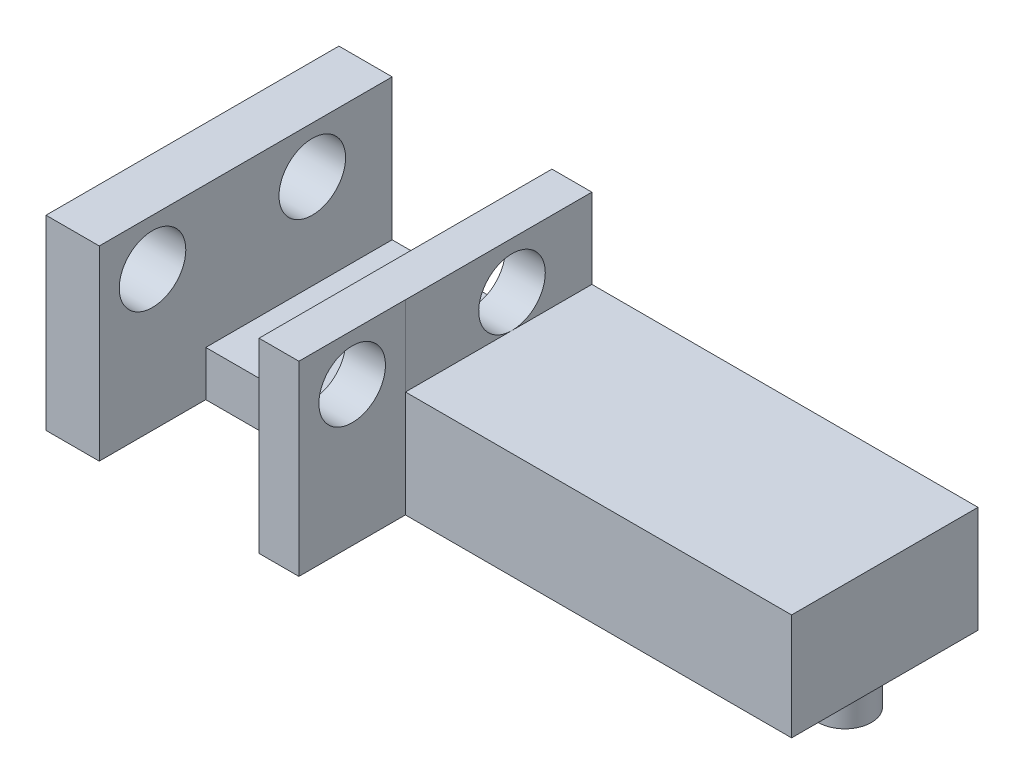
ISO-10303-21;
HEADER;
FILE_DESCRIPTION(('STEP AP214'),'2;1');
FILE_NAME('part.step','',(''),(''),'','','');
FILE_SCHEMA(('AUTOMOTIVE_DESIGN { 1 0 10303 214 1 1 1 1 }'));
ENDSEC;
DATA;
#1=APPLICATION_CONTEXT('core data for automotive mechanical design processes');
#2=APPLICATION_PROTOCOL_DEFINITION('international standard','automotive_design',2000,#1);
#3=PRODUCT_CONTEXT('',#1,'mechanical');
#4=PRODUCT('Part','Part','',(#3));
#5=PRODUCT_RELATED_PRODUCT_CATEGORY('part','',(#4));
#6=PRODUCT_DEFINITION_FORMATION('','',#4);
#7=PRODUCT_DEFINITION_CONTEXT('part definition',#1,'design');
#8=PRODUCT_DEFINITION('design','',#6,#7);
#9=PRODUCT_DEFINITION_SHAPE('','',#8);
#10=(LENGTH_UNIT() NAMED_UNIT(*) SI_UNIT(.MILLI.,.METRE.));
#11=(NAMED_UNIT(*) PLANE_ANGLE_UNIT() SI_UNIT($,.RADIAN.));
#12=(NAMED_UNIT(*) SI_UNIT($,.STERADIAN.) SOLID_ANGLE_UNIT());
#13=UNCERTAINTY_MEASURE_WITH_UNIT(LENGTH_MEASURE(1.E-05),#10,'distance_accuracy_value','');
#14=(GEOMETRIC_REPRESENTATION_CONTEXT(3) GLOBAL_UNCERTAINTY_ASSIGNED_CONTEXT((#13)) GLOBAL_UNIT_ASSIGNED_CONTEXT((#10,
#11,#12)) REPRESENTATION_CONTEXT('',''));
#15=CARTESIAN_POINT('',(0.,0.,0.));
#16=DIRECTION('',(0.,0.,1.));
#17=DIRECTION('',(1.,0.,0.));
#18=AXIS2_PLACEMENT_3D('',#15,#16,#17);
#19=CARTESIAN_POINT('',(0.,0.,3.));
#20=DIRECTION('',(0.,0.,-1.));
#21=DIRECTION('',(-1.,0.,0.));
#22=AXIS2_PLACEMENT_3D('',#19,#20,#21);
#23=PLANE('',#22);
#24=DIRECTION('',(0.,-1.,0.));
#25=VECTOR('',#24,1.);
#26=CARTESIAN_POINT('',(-17.,7.,3.));
#27=LINE('',#26,#25);
#28=CARTESIAN_POINT('',(-17.,1.7,3.));
#29=VERTEX_POINT('',#28);
#30=CARTESIAN_POINT('',(-17.,0.,3.));
#31=VERTEX_POINT('',#30);
#32=EDGE_CURVE('E168',#29,#31,#27,.T.);
#33=ORIENTED_EDGE('',*,*,#32,.F.);
#34=DIRECTION('',(1.,0.,0.));
#35=VECTOR('',#34,1.);
#36=CARTESIAN_POINT('',(0.,1.7,3.));
#37=LINE('',#36,#35);
#38=CARTESIAN_POINT('',(-23.,1.7,3.));
#39=VERTEX_POINT('',#38);
#40=EDGE_CURVE('E216',#39,#29,#37,.T.);
#41=ORIENTED_EDGE('',*,*,#40,.F.);
#42=DIRECTION('',(0.,1.,0.));
#43=VECTOR('',#42,1.);
#44=CARTESIAN_POINT('',(-23.,7.,3.));
#45=LINE('',#44,#43);
#46=CARTESIAN_POINT('',(-23.,0.,3.));
#47=VERTEX_POINT('',#46);
#48=EDGE_CURVE('E169',#47,#39,#45,.T.);
#49=ORIENTED_EDGE('',*,*,#48,.F.);
#50=DIRECTION('',(1.,0.,0.));
#51=VECTOR('',#50,1.);
#52=CARTESIAN_POINT('',(-25.,0.,3.));
#53=LINE('',#52,#51);
#54=EDGE_CURVE('E232',#47,#31,#53,.T.);
#55=ORIENTED_EDGE('',*,*,#54,.T.);
#56=EDGE_LOOP('',(#33,#41,#49,#55));
#57=FACE_BOUND('',#56,.T.);
#58=ADVANCED_FACE('F37',(#57),#23,.F.);
#59=DIRECTION('',(0.,1.,0.));
#60=VECTOR('',#59,1.);
#61=CARTESIAN_POINT('',(-15.5025294120522,7.,3.));
#62=LINE('',#61,#60);
#63=CARTESIAN_POINT('',(-15.5025294120522,0.,3.));
#64=VERTEX_POINT('',#63);
#65=CARTESIAN_POINT('',(-15.5025294120522,7.,3.));
#66=VERTEX_POINT('',#65);
#67=EDGE_CURVE('E164',#64,#66,#62,.T.);
#68=ORIENTED_EDGE('',*,*,#67,.F.);
#69=CARTESIAN_POINT('',(-1.,0.,3.));
#70=VERTEX_POINT('',#69);
#71=EDGE_CURVE('E230',#64,#70,#53,.T.);
#72=ORIENTED_EDGE('',*,*,#71,.T.);
#73=DIRECTION('',(0.,1.,0.));
#74=VECTOR('',#73,1.);
#75=CARTESIAN_POINT('',(-1.,0.,3.));
#76=LINE('',#75,#74);
#77=CARTESIAN_POINT('',(-1.,4.,3.));
#78=VERTEX_POINT('',#77);
#79=EDGE_CURVE('E234',#70,#78,#76,.T.);
#80=ORIENTED_EDGE('',*,*,#79,.T.);
#81=DIRECTION('',(-1.,0.,0.));
#82=VECTOR('',#81,1.);
#83=CARTESIAN_POINT('',(-25.,4.,3.));
#84=LINE('',#83,#82);
#85=CARTESIAN_POINT('',(-15.5,4.,3.));
#86=VERTEX_POINT('',#85);
#87=EDGE_CURVE('E237',#78,#86,#84,.T.);
#88=ORIENTED_EDGE('',*,*,#87,.T.);
#89=DIRECTION('',(0.,-1.,0.));
#90=VECTOR('',#89,1.);
#91=CARTESIAN_POINT('',(-15.5,7.,3.));
#92=LINE('',#91,#90);
#93=CARTESIAN_POINT('',(-15.5,7.,3.));
#94=VERTEX_POINT('',#93);
#95=EDGE_CURVE('E206',#94,#86,#92,.T.);
#96=ORIENTED_EDGE('',*,*,#95,.F.);
#97=DIRECTION('',(1.,0.,0.));
#98=VECTOR('',#97,1.);
#99=CARTESIAN_POINT('',(-17.,7.,3.));
#100=LINE('',#99,#98);
#101=EDGE_CURVE('E193',#66,#94,#100,.T.);
#102=ORIENTED_EDGE('',*,*,#101,.F.);
#103=EDGE_LOOP('',(#68,#72,#80,#88,#96,#102));
#104=FACE_BOUND('',#103,.T.);
#105=ADVANCED_FACE('F292',(#104),#23,.F.);
#106=CARTESIAN_POINT('',(0.,4.,0.));
#107=DIRECTION('',(0.,1.,0.));
#108=DIRECTION('',(0.,0.,1.));
#109=AXIS2_PLACEMENT_3D('',#106,#107,#108);
#110=PLANE('',#109);
#111=DIRECTION('',(1.,0.,0.));
#112=VECTOR('',#111,1.);
#113=CARTESIAN_POINT('',(0.,4.,-4.));
#114=LINE('',#113,#112);
#115=CARTESIAN_POINT('',(-15.5,4.,-4.));
#116=VERTEX_POINT('',#115);
#117=CARTESIAN_POINT('',(-1.,4.,-4.));
#118=VERTEX_POINT('',#117);
#119=EDGE_CURVE('E262',#116,#118,#114,.T.);
#120=ORIENTED_EDGE('',*,*,#119,.F.);
#121=DIRECTION('',(0.,0.,-1.));
#122=VECTOR('',#121,1.);
#123=CARTESIAN_POINT('',(-15.5,4.,3.));
#124=LINE('',#123,#122);
#125=CARTESIAN_POINT('',(-15.5,4.,-1.));
#126=VERTEX_POINT('',#125);
#127=EDGE_CURVE('E190',#126,#116,#124,.T.);
#128=ORIENTED_EDGE('',*,*,#127,.F.);
#129=EDGE_CURVE('E194',#86,#126,#124,.T.);
#130=ORIENTED_EDGE('',*,*,#129,.F.);
#131=ORIENTED_EDGE('',*,*,#87,.F.);
#132=DIRECTION('',(0.,0.,-1.));
#133=VECTOR('',#132,1.);
#134=CARTESIAN_POINT('',(-1.,4.,0.));
#135=LINE('',#134,#133);
#136=EDGE_CURVE('E259',#78,#118,#135,.T.);
#137=ORIENTED_EDGE('',*,*,#136,.T.);
#138=EDGE_LOOP('',(#120,#128,#130,#131,#137));
#139=FACE_BOUND('',#138,.T.);
#140=ADVANCED_FACE('F288',(#139),#110,.T.);
#141=CARTESIAN_POINT('',(0.,4.,-4.));
#142=DIRECTION('',(0.,0.,-1.));
#143=DIRECTION('',(-1.,0.,0.));
#144=AXIS2_PLACEMENT_3D('',#141,#142,#143);
#145=PLANE('',#144);
#146=DIRECTION('',(0.,-1.,0.));
#147=VECTOR('',#146,1.);
#148=CARTESIAN_POINT('',(-25.,4.,-4.));
#149=LINE('',#148,#147);
#150=CARTESIAN_POINT('',(-25.,7.,-4.));
#151=VERTEX_POINT('',#150);
#152=CARTESIAN_POINT('',(-25.,0.,-4.));
#153=VERTEX_POINT('',#152);
#154=EDGE_CURVE('E265',#151,#153,#149,.T.);
#155=ORIENTED_EDGE('',*,*,#154,.F.);
#156=DIRECTION('',(-1.,0.,0.));
#157=VECTOR('',#156,1.);
#158=CARTESIAN_POINT('',(-23.,7.,-4.));
#159=LINE('',#158,#157);
#160=CARTESIAN_POINT('',(-23.,7.,-4.));
#161=VERTEX_POINT('',#160);
#162=EDGE_CURVE('E211',#161,#151,#159,.T.);
#163=ORIENTED_EDGE('',*,*,#162,.F.);
#164=DIRECTION('',(0.,1.,0.));
#165=VECTOR('',#164,1.);
#166=CARTESIAN_POINT('',(-23.,1.7,-4.));
#167=LINE('',#166,#165);
#168=CARTESIAN_POINT('',(-23.,1.7,-4.));
#169=VERTEX_POINT('',#168);
#170=EDGE_CURVE('E228',#169,#161,#167,.T.);
#171=ORIENTED_EDGE('',*,*,#170,.F.);
#172=DIRECTION('',(-1.,0.,0.));
#173=VECTOR('',#172,1.);
#174=CARTESIAN_POINT('',(0.,1.7,-4.));
#175=LINE('',#174,#173);
#176=CARTESIAN_POINT('',(-17.,1.7,-4.));
#177=VERTEX_POINT('',#176);
#178=EDGE_CURVE('E222',#177,#169,#175,.T.);
#179=ORIENTED_EDGE('',*,*,#178,.F.);
#180=DIRECTION('',(0.,1.,0.));
#181=VECTOR('',#180,1.);
#182=CARTESIAN_POINT('',(-17.,1.7,-4.));
#183=LINE('',#182,#181);
#184=CARTESIAN_POINT('',(-17.,7.,-4.));
#185=VERTEX_POINT('',#184);
#186=EDGE_CURVE('E227',#177,#185,#183,.T.);
#187=ORIENTED_EDGE('',*,*,#186,.T.);
#188=DIRECTION('',(-1.,0.,0.));
#189=VECTOR('',#188,1.);
#190=CARTESIAN_POINT('',(-17.,7.,-4.));
#191=LINE('',#190,#189);
#192=CARTESIAN_POINT('',(-15.5,7.,-4.));
#193=VERTEX_POINT('',#192);
#194=EDGE_CURVE('E198',#193,#185,#191,.T.);
#195=ORIENTED_EDGE('',*,*,#194,.F.);
#196=DIRECTION('',(0.,-1.,0.));
#197=VECTOR('',#196,1.);
#198=CARTESIAN_POINT('',(-15.5,7.,-4.));
#199=LINE('',#198,#197);
#200=EDGE_CURVE('E201',#193,#116,#199,.T.);
#201=ORIENTED_EDGE('',*,*,#200,.T.);
#202=ORIENTED_EDGE('',*,*,#119,.T.);
#203=DIRECTION('',(0.,-1.,0.));
#204=VECTOR('',#203,1.);
#205=CARTESIAN_POINT('',(-1.,4.,-4.));
#206=LINE('',#205,#204);
#207=CARTESIAN_POINT('',(-1.,0.,-4.));
#208=VERTEX_POINT('',#207);
#209=EDGE_CURVE('E273',#118,#208,#206,.T.);
#210=ORIENTED_EDGE('',*,*,#209,.T.);
#211=DIRECTION('',(1.,0.,0.));
#212=VECTOR('',#211,1.);
#213=CARTESIAN_POINT('',(0.,0.,-4.));
#214=LINE('',#213,#212);
#215=EDGE_CURVE('E263',#153,#208,#214,.T.);
#216=ORIENTED_EDGE('',*,*,#215,.F.);
#217=EDGE_LOOP('',(#155,#163,#171,#179,#187,#195,#201,#202,#210,#216));
#218=FACE_BOUND('',#217,.T.);
#219=ADVANCED_FACE('F280',(#218),#145,.T.);
#220=CARTESIAN_POINT('',(-18.5,-3.,-2.));
#221=DIRECTION('',(0.,1.,0.));
#222=DIRECTION('',(0.,0.,1.));
#223=AXIS2_PLACEMENT_3D('',#220,#221,#222);
#224=CYLINDRICAL_SURFACE('',#223,1.5);
#225=CARTESIAN_POINT('',(-18.5,-3.,-2.));
#226=DIRECTION('',(0.,1.,0.));
#227=DIRECTION('',(0.,0.,1.));
#228=AXIS2_PLACEMENT_3D('',#225,#226,#227);
#229=CIRCLE('',#228,1.5);
#230=CARTESIAN_POINT('',(-18.5,-3.,-0.500000000000003));
#231=VERTEX_POINT('',#230);
#232=EDGE_CURVE('E11',#231,#231,#229,.T.);
#233=ORIENTED_EDGE('',*,*,#232,.T.);
#234=EDGE_LOOP('',(#233));
#235=FACE_BOUND('',#234,.T.);
#236=CARTESIAN_POINT('',(-18.5,0.,-2.));
#237=DIRECTION('',(0.,1.,0.));
#238=DIRECTION('',(0.,0.,1.));
#239=AXIS2_PLACEMENT_3D('',#236,#237,#238);
#240=CIRCLE('',#239,1.5);
#241=CARTESIAN_POINT('',(-18.5,0.,-0.500000000000003));
#242=VERTEX_POINT('',#241);
#243=EDGE_CURVE('E46',#242,#242,#240,.T.);
#244=ORIENTED_EDGE('',*,*,#243,.F.);
#245=EDGE_LOOP('',(#244));
#246=FACE_BOUND('',#245,.T.);
#247=ADVANCED_FACE('F39',(#235,#246),#224,.T.);
#248=CARTESIAN_POINT('',(0.,-3.,0.));
#249=DIRECTION('',(0.,1.,0.));
#250=DIRECTION('',(0.,0.,1.));
#251=AXIS2_PLACEMENT_3D('',#248,#249,#250);
#252=PLANE('',#251);
#253=ORIENTED_EDGE('',*,*,#232,.F.);
#254=EDGE_LOOP('',(#253));
#255=FACE_BOUND('',#254,.T.);
#256=ADVANCED_FACE('F279',(#255),#252,.F.);
#257=CARTESIAN_POINT('',(-25.,4.,0.));
#258=DIRECTION('',(-1.,0.,0.));
#259=DIRECTION('',(0.,0.,1.));
#260=AXIS2_PLACEMENT_3D('',#257,#258,#259);
#261=PLANE('',#260);
#262=CARTESIAN_POINT('',(-25.,5.25,5.));
#263=DIRECTION('',(1.,0.,0.));
#264=DIRECTION('',(0.,0.,-1.));
#265=AXIS2_PLACEMENT_3D('',#262,#263,#264);
#266=CIRCLE('',#265,1.25);
#267=CARTESIAN_POINT('',(-25.,5.25,3.75));
#268=VERTEX_POINT('',#267);
#269=EDGE_CURVE('E344',#268,#268,#266,.T.);
#270=ORIENTED_EDGE('',*,*,#269,.T.);
#271=EDGE_LOOP('',(#270));
#272=FACE_BOUND('',#271,.T.);
#273=CARTESIAN_POINT('',(-25.,5.25,-1.));
#274=DIRECTION('',(1.,0.,0.));
#275=DIRECTION('',(0.,0.,-1.));
#276=AXIS2_PLACEMENT_3D('',#273,#274,#275);
#277=CIRCLE('',#276,1.25);
#278=CARTESIAN_POINT('',(-25.,5.25,-2.25));
#279=VERTEX_POINT('',#278);
#280=EDGE_CURVE('E348',#279,#279,#277,.T.);
#281=ORIENTED_EDGE('',*,*,#280,.T.);
#282=EDGE_LOOP('',(#281));
#283=FACE_BOUND('',#282,.T.);
#284=DIRECTION('',(0.,0.,-1.));
#285=VECTOR('',#284,1.);
#286=CARTESIAN_POINT('',(-25.,0.,0.));
#287=LINE('',#286,#285);
#288=CARTESIAN_POINT('',(-25.,0.,7.));
#289=VERTEX_POINT('',#288);
#290=EDGE_CURVE('E256',#289,#153,#287,.T.);
#291=ORIENTED_EDGE('',*,*,#290,.F.);
#292=DIRECTION('',(0.,-1.,0.));
#293=VECTOR('',#292,1.);
#294=CARTESIAN_POINT('',(-25.,7.,7.));
#295=LINE('',#294,#293);
#296=CARTESIAN_POINT('',(-25.,7.,7.));
#297=VERTEX_POINT('',#296);
#298=EDGE_CURVE('E172',#297,#289,#295,.T.);
#299=ORIENTED_EDGE('',*,*,#298,.F.);
#300=DIRECTION('',(0.,0.,1.));
#301=VECTOR('',#300,1.);
#302=CARTESIAN_POINT('',(-25.,7.,3.));
#303=LINE('',#302,#301);
#304=EDGE_CURVE('E214',#151,#297,#303,.T.);
#305=ORIENTED_EDGE('',*,*,#304,.F.);
#306=ORIENTED_EDGE('',*,*,#154,.T.);
#307=EDGE_LOOP('',(#291,#299,#305,#306));
#308=FACE_BOUND('',#307,.T.);
#309=ADVANCED_FACE('F286',(#272,#283,#308),#261,.T.);
#310=CARTESIAN_POINT('',(-1.,4.,0.));
#311=DIRECTION('',(-1.,0.,0.));
#312=DIRECTION('',(0.,0.,1.));
#313=AXIS2_PLACEMENT_3D('',#310,#311,#312);
#314=PLANE('',#313);
#315=DIRECTION('',(0.,0.,-1.));
#316=VECTOR('',#315,1.);
#317=CARTESIAN_POINT('',(-1.,0.,0.));
#318=LINE('',#317,#316);
#319=EDGE_CURVE('E267',#70,#208,#318,.T.);
#320=ORIENTED_EDGE('',*,*,#319,.T.);
#321=ORIENTED_EDGE('',*,*,#209,.F.);
#322=ORIENTED_EDGE('',*,*,#136,.F.);
#323=ORIENTED_EDGE('',*,*,#79,.F.);
#324=EDGE_LOOP('',(#320,#321,#322,#323));
#325=FACE_BOUND('',#324,.T.);
#326=ADVANCED_FACE('F331',(#325),#314,.F.);
#327=CARTESIAN_POINT('',(0.,0.,0.));
#328=DIRECTION('',(0.,1.,0.));
#329=DIRECTION('',(0.,0.,1.));
#330=AXIS2_PLACEMENT_3D('',#327,#328,#329);
#331=PLANE('',#330);
#332=CARTESIAN_POINT('',(-4.,0.,-2.));
#333=DIRECTION('',(0.,1.,0.));
#334=DIRECTION('',(0.,0.,1.));
#335=AXIS2_PLACEMENT_3D('',#332,#333,#334);
#336=CIRCLE('',#335,1.);
#337=CARTESIAN_POINT('',(-4.,0.,-1.));
#338=VERTEX_POINT('',#337);
#339=EDGE_CURVE('E240',#338,#338,#336,.T.);
#340=ORIENTED_EDGE('',*,*,#339,.T.);
#341=EDGE_LOOP('',(#340));
#342=FACE_BOUND('',#341,.T.);
#343=CARTESIAN_POINT('',(-14.,0.,-2.));
#344=DIRECTION('',(0.,1.,0.));
#345=DIRECTION('',(0.,0.,1.));
#346=AXIS2_PLACEMENT_3D('',#343,#344,#345);
#347=CIRCLE('',#346,1.);
#348=CARTESIAN_POINT('',(-14.,0.,-0.999999999999999));
#349=VERTEX_POINT('',#348);
#350=EDGE_CURVE('E244',#349,#349,#347,.T.);
#351=ORIENTED_EDGE('',*,*,#350,.T.);
#352=EDGE_LOOP('',(#351));
#353=FACE_BOUND('',#352,.T.);
#354=CARTESIAN_POINT('',(-23.,0.,-2.));
#355=DIRECTION('',(0.,1.,0.));
#356=DIRECTION('',(0.,0.,1.));
#357=AXIS2_PLACEMENT_3D('',#354,#355,#356);
#358=CIRCLE('',#357,1.);
#359=CARTESIAN_POINT('',(-23.,0.,-0.999999999999999));
#360=VERTEX_POINT('',#359);
#361=EDGE_CURVE('E250',#360,#360,#358,.T.);
#362=ORIENTED_EDGE('',*,*,#361,.T.);
#363=EDGE_LOOP('',(#362));
#364=FACE_BOUND('',#363,.T.);
#365=ORIENTED_EDGE('',*,*,#243,.T.);
#366=EDGE_LOOP('',(#365));
#367=FACE_BOUND('',#366,.T.);
#368=ORIENTED_EDGE('',*,*,#290,.T.);
#369=ORIENTED_EDGE('',*,*,#215,.T.);
#370=ORIENTED_EDGE('',*,*,#319,.F.);
#371=ORIENTED_EDGE('',*,*,#71,.F.);
#372=DIRECTION('',(0.,0.,-1.));
#373=VECTOR('',#372,1.);
#374=CARTESIAN_POINT('',(-15.5025294120522,0.,7.));
#375=LINE('',#374,#373);
#376=CARTESIAN_POINT('',(-15.5025294120522,0.,7.));
#377=VERTEX_POINT('',#376);
#378=EDGE_CURVE('E152',#377,#64,#375,.T.);
#379=ORIENTED_EDGE('',*,*,#378,.F.);
#380=DIRECTION('',(1.,0.,0.));
#381=VECTOR('',#380,1.);
#382=CARTESIAN_POINT('',(-17.,0.,7.));
#383=LINE('',#382,#381);
#384=CARTESIAN_POINT('',(-17.,0.,7.));
#385=VERTEX_POINT('',#384);
#386=EDGE_CURVE('E143',#385,#377,#383,.T.);
#387=ORIENTED_EDGE('',*,*,#386,.F.);
#388=DIRECTION('',(0.,0.,-1.));
#389=VECTOR('',#388,1.);
#390=CARTESIAN_POINT('',(-17.,0.,7.));
#391=LINE('',#390,#389);
#392=EDGE_CURVE('E149',#385,#31,#391,.T.);
#393=ORIENTED_EDGE('',*,*,#392,.T.);
#394=ORIENTED_EDGE('',*,*,#54,.F.);
#395=DIRECTION('',(0.,0.,-1.));
#396=VECTOR('',#395,1.);
#397=CARTESIAN_POINT('',(-23.,0.,7.));
#398=LINE('',#397,#396);
#399=CARTESIAN_POINT('',(-23.,0.,7.));
#400=VERTEX_POINT('',#399);
#401=EDGE_CURVE('E186',#400,#47,#398,.T.);
#402=ORIENTED_EDGE('',*,*,#401,.F.);
#403=DIRECTION('',(1.,0.,0.));
#404=VECTOR('',#403,1.);
#405=CARTESIAN_POINT('',(-25.,0.,7.));
#406=LINE('',#405,#404);
#407=EDGE_CURVE('E179',#289,#400,#406,.T.);
#408=ORIENTED_EDGE('',*,*,#407,.F.);
#409=EDGE_LOOP('',(#368,#369,#370,#371,#379,#387,#393,#394,#402,#408));
#410=FACE_BOUND('',#409,.T.);
#411=ADVANCED_FACE('F146',(#342,#353,#364,#367,#410),#331,.F.);
#412=CARTESIAN_POINT('',(-23.,-3.,-2.));
#413=DIRECTION('',(0.,1.,0.));
#414=DIRECTION('',(0.,0.,1.));
#415=AXIS2_PLACEMENT_3D('',#412,#413,#414);
#416=CYLINDRICAL_SURFACE('',#415,1.);
#417=CARTESIAN_POINT('',(-23.,-3.,-2.));
#418=DIRECTION('',(0.,1.,0.));
#419=DIRECTION('',(0.,0.,1.));
#420=AXIS2_PLACEMENT_3D('',#417,#418,#419);
#421=CIRCLE('',#420,1.);
#422=CARTESIAN_POINT('',(-23.,-3.,-0.999999999999999));
#423=VERTEX_POINT('',#422);
#424=EDGE_CURVE('E253',#423,#423,#421,.T.);
#425=ORIENTED_EDGE('',*,*,#424,.T.);
#426=EDGE_LOOP('',(#425));
#427=FACE_BOUND('',#426,.T.);
#428=ORIENTED_EDGE('',*,*,#361,.F.);
#429=EDGE_LOOP('',(#428));
#430=FACE_BOUND('',#429,.T.);
#431=ADVANCED_FACE('F322',(#427,#430),#416,.T.);
#432=CARTESIAN_POINT('',(0.,-3.,0.));
#433=DIRECTION('',(0.,1.,0.));
#434=DIRECTION('',(0.,0.,1.));
#435=AXIS2_PLACEMENT_3D('',#432,#433,#434);
#436=PLANE('',#435);
#437=ORIENTED_EDGE('',*,*,#424,.F.);
#438=EDGE_LOOP('',(#437));
#439=FACE_BOUND('',#438,.T.);
#440=ADVANCED_FACE('F318',(#439),#436,.F.);
#441=CARTESIAN_POINT('',(-14.,-3.,-2.));
#442=DIRECTION('',(0.,1.,0.));
#443=DIRECTION('',(0.,0.,1.));
#444=AXIS2_PLACEMENT_3D('',#441,#442,#443);
#445=CYLINDRICAL_SURFACE('',#444,1.);
#446=CARTESIAN_POINT('',(-14.,-3.,-2.));
#447=DIRECTION('',(0.,1.,0.));
#448=DIRECTION('',(0.,0.,1.));
#449=AXIS2_PLACEMENT_3D('',#446,#447,#448);
#450=CIRCLE('',#449,1.);
#451=CARTESIAN_POINT('',(-14.,-3.,-0.999999999999999));
#452=VERTEX_POINT('',#451);
#453=EDGE_CURVE('E247',#452,#452,#450,.T.);
#454=ORIENTED_EDGE('',*,*,#453,.T.);
#455=EDGE_LOOP('',(#454));
#456=FACE_BOUND('',#455,.T.);
#457=ORIENTED_EDGE('',*,*,#350,.F.);
#458=EDGE_LOOP('',(#457));
#459=FACE_BOUND('',#458,.T.);
#460=ADVANCED_FACE('F314',(#456,#459),#445,.T.);
#461=CARTESIAN_POINT('',(0.,-3.,0.));
#462=DIRECTION('',(0.,1.,0.));
#463=DIRECTION('',(0.,0.,1.));
#464=AXIS2_PLACEMENT_3D('',#461,#462,#463);
#465=PLANE('',#464);
#466=ORIENTED_EDGE('',*,*,#453,.F.);
#467=EDGE_LOOP('',(#466));
#468=FACE_BOUND('',#467,.T.);
#469=ADVANCED_FACE('F310',(#468),#465,.F.);
#470=CARTESIAN_POINT('',(-4.,-3.,-2.));
#471=DIRECTION('',(0.,1.,0.));
#472=DIRECTION('',(0.,0.,1.));
#473=AXIS2_PLACEMENT_3D('',#470,#471,#472);
#474=CYLINDRICAL_SURFACE('',#473,1.);
#475=CARTESIAN_POINT('',(-4.,-3.,-2.));
#476=DIRECTION('',(0.,1.,0.));
#477=DIRECTION('',(0.,0.,1.));
#478=AXIS2_PLACEMENT_3D('',#475,#476,#477);
#479=CIRCLE('',#478,1.);
#480=CARTESIAN_POINT('',(-4.,-3.,-1.));
#481=VERTEX_POINT('',#480);
#482=EDGE_CURVE('E241',#481,#481,#479,.T.);
#483=ORIENTED_EDGE('',*,*,#482,.T.);
#484=EDGE_LOOP('',(#483));
#485=FACE_BOUND('',#484,.T.);
#486=ORIENTED_EDGE('',*,*,#339,.F.);
#487=EDGE_LOOP('',(#486));
#488=FACE_BOUND('',#487,.T.);
#489=ADVANCED_FACE('F306',(#485,#488),#474,.T.);
#490=CARTESIAN_POINT('',(0.,-3.,0.));
#491=DIRECTION('',(0.,1.,0.));
#492=DIRECTION('',(0.,0.,1.));
#493=AXIS2_PLACEMENT_3D('',#490,#491,#492);
#494=PLANE('',#493);
#495=ORIENTED_EDGE('',*,*,#482,.F.);
#496=EDGE_LOOP('',(#495));
#497=FACE_BOUND('',#496,.T.);
#498=ADVANCED_FACE('F302',(#497),#494,.F.);
#499=CARTESIAN_POINT('',(-23.,1.7,0.));
#500=DIRECTION('',(1.,0.,0.));
#501=DIRECTION('',(0.,0.,-1.));
#502=AXIS2_PLACEMENT_3D('',#499,#500,#501);
#503=PLANE('',#502);
#504=CARTESIAN_POINT('',(-23.,5.25,5.));
#505=DIRECTION('',(1.,0.,0.));
#506=DIRECTION('',(0.,0.,-1.));
#507=AXIS2_PLACEMENT_3D('',#504,#505,#506);
#508=CIRCLE('',#507,1.25);
#509=CARTESIAN_POINT('',(-23.,5.25,3.75));
#510=VERTEX_POINT('',#509);
#511=EDGE_CURVE('E428',#510,#510,#508,.T.);
#512=ORIENTED_EDGE('',*,*,#511,.F.);
#513=EDGE_LOOP('',(#512));
#514=FACE_BOUND('',#513,.T.);
#515=CARTESIAN_POINT('',(-23.,5.25,-1.));
#516=DIRECTION('',(1.,0.,0.));
#517=DIRECTION('',(0.,0.,-1.));
#518=AXIS2_PLACEMENT_3D('',#515,#516,#517);
#519=CIRCLE('',#518,1.25);
#520=CARTESIAN_POINT('',(-23.,5.25,-2.25));
#521=VERTEX_POINT('',#520);
#522=EDGE_CURVE('E441',#521,#521,#519,.T.);
#523=ORIENTED_EDGE('',*,*,#522,.F.);
#524=EDGE_LOOP('',(#523));
#525=FACE_BOUND('',#524,.T.);
#526=ORIENTED_EDGE('',*,*,#170,.T.);
#527=DIRECTION('',(0.,0.,-1.));
#528=VECTOR('',#527,1.);
#529=CARTESIAN_POINT('',(-23.,7.,3.));
#530=LINE('',#529,#528);
#531=CARTESIAN_POINT('',(-23.,7.,7.));
#532=VERTEX_POINT('',#531);
#533=EDGE_CURVE('E208',#532,#161,#530,.T.);
#534=ORIENTED_EDGE('',*,*,#533,.F.);
#535=DIRECTION('',(0.,1.,0.));
#536=VECTOR('',#535,1.);
#537=CARTESIAN_POINT('',(-23.,7.,7.));
#538=LINE('',#537,#536);
#539=EDGE_CURVE('E181',#400,#532,#538,.T.);
#540=ORIENTED_EDGE('',*,*,#539,.F.);
#541=ORIENTED_EDGE('',*,*,#401,.T.);
#542=ORIENTED_EDGE('',*,*,#48,.T.);
#543=DIRECTION('',(0.,0.,-1.));
#544=VECTOR('',#543,1.);
#545=CARTESIAN_POINT('',(-23.,1.7,0.));
#546=LINE('',#545,#544);
#547=EDGE_CURVE('E225',#39,#169,#546,.T.);
#548=ORIENTED_EDGE('',*,*,#547,.T.);
#549=EDGE_LOOP('',(#526,#534,#540,#541,#542,#548));
#550=FACE_BOUND('',#549,.T.);
#551=ADVANCED_FACE('F305',(#514,#525,#550),#503,.T.);
#552=CARTESIAN_POINT('',(-17.,1.7,0.));
#553=DIRECTION('',(1.,0.,0.));
#554=DIRECTION('',(0.,0.,-1.));
#555=AXIS2_PLACEMENT_3D('',#552,#553,#554);
#556=PLANE('',#555);
#557=CARTESIAN_POINT('',(-17.,5.25,5.));
#558=DIRECTION('',(1.,0.,0.));
#559=DIRECTION('',(0.,0.,-1.));
#560=AXIS2_PLACEMENT_3D('',#557,#558,#559);
#561=CIRCLE('',#560,1.25);
#562=CARTESIAN_POINT('',(-17.,5.25,3.75));
#563=VERTEX_POINT('',#562);
#564=EDGE_CURVE('E431',#563,#563,#561,.T.);
#565=ORIENTED_EDGE('',*,*,#564,.T.);
#566=EDGE_LOOP('',(#565));
#567=FACE_BOUND('',#566,.T.);
#568=CARTESIAN_POINT('',(-17.,5.25,-1.));
#569=DIRECTION('',(1.,0.,0.));
#570=DIRECTION('',(0.,0.,-1.));
#571=AXIS2_PLACEMENT_3D('',#568,#569,#570);
#572=CIRCLE('',#571,1.25);
#573=CARTESIAN_POINT('',(-17.,5.25,-2.25));
#574=VERTEX_POINT('',#573);
#575=EDGE_CURVE('E438',#574,#574,#572,.T.);
#576=ORIENTED_EDGE('',*,*,#575,.T.);
#577=EDGE_LOOP('',(#576));
#578=FACE_BOUND('',#577,.T.);
#579=DIRECTION('',(0.,0.,-1.));
#580=VECTOR('',#579,1.);
#581=CARTESIAN_POINT('',(-17.,1.7,0.));
#582=LINE('',#581,#580);
#583=EDGE_CURVE('E219',#29,#177,#582,.T.);
#584=ORIENTED_EDGE('',*,*,#583,.F.);
#585=ORIENTED_EDGE('',*,*,#32,.T.);
#586=ORIENTED_EDGE('',*,*,#392,.F.);
#587=DIRECTION('',(0.,-1.,0.));
#588=VECTOR('',#587,1.);
#589=CARTESIAN_POINT('',(-17.,7.,7.));
#590=LINE('',#589,#588);
#591=CARTESIAN_POINT('',(-17.,7.,7.));
#592=VERTEX_POINT('',#591);
#593=EDGE_CURVE('E156',#592,#385,#590,.T.);
#594=ORIENTED_EDGE('',*,*,#593,.F.);
#595=DIRECTION('',(0.,0.,1.));
#596=VECTOR('',#595,1.);
#597=CARTESIAN_POINT('',(-17.,7.,3.));
#598=LINE('',#597,#596);
#599=EDGE_CURVE('E191',#185,#592,#598,.T.);
#600=ORIENTED_EDGE('',*,*,#599,.F.);
#601=ORIENTED_EDGE('',*,*,#186,.F.);
#602=EDGE_LOOP('',(#584,#585,#586,#594,#600,#601));
#603=FACE_BOUND('',#602,.T.);
#604=ADVANCED_FACE('F167',(#567,#578,#603),#556,.F.);
#605=CARTESIAN_POINT('',(0.,1.7,0.));
#606=DIRECTION('',(0.,1.,0.));
#607=DIRECTION('',(0.,0.,1.));
#608=AXIS2_PLACEMENT_3D('',#605,#606,#607);
#609=PLANE('',#608);
#610=ORIENTED_EDGE('',*,*,#40,.T.);
#611=ORIENTED_EDGE('',*,*,#583,.T.);
#612=ORIENTED_EDGE('',*,*,#178,.T.);
#613=ORIENTED_EDGE('',*,*,#547,.F.);
#614=EDGE_LOOP('',(#610,#611,#612,#613));
#615=FACE_BOUND('',#614,.T.);
#616=ADVANCED_FACE('F380',(#615),#609,.T.);
#617=CARTESIAN_POINT('',(0.,7.,0.));
#618=DIRECTION('',(0.,1.,0.));
#619=DIRECTION('',(0.,0.,1.));
#620=AXIS2_PLACEMENT_3D('',#617,#618,#619);
#621=PLANE('',#620);
#622=ORIENTED_EDGE('',*,*,#533,.T.);
#623=ORIENTED_EDGE('',*,*,#162,.T.);
#624=ORIENTED_EDGE('',*,*,#304,.T.);
#625=DIRECTION('',(-1.,0.,0.));
#626=VECTOR('',#625,1.);
#627=CARTESIAN_POINT('',(-25.,7.,7.));
#628=LINE('',#627,#626);
#629=EDGE_CURVE('E184',#532,#297,#628,.T.);
#630=ORIENTED_EDGE('',*,*,#629,.F.);
#631=EDGE_LOOP('',(#622,#623,#624,#630));
#632=FACE_BOUND('',#631,.T.);
#633=ADVANCED_FACE('F359',(#632),#621,.T.);
#634=CARTESIAN_POINT('',(-15.5,7.,3.));
#635=DIRECTION('',(-1.,0.,0.));
#636=DIRECTION('',(0.,0.,1.));
#637=AXIS2_PLACEMENT_3D('',#634,#635,#636);
#638=PLANE('',#637);
#639=ORIENTED_EDGE('',*,*,#129,.T.);
#640=CARTESIAN_POINT('',(-15.5,5.25,-1.));
#641=DIRECTION('',(1.,0.,0.));
#642=DIRECTION('',(0.,0.,-1.));
#643=AXIS2_PLACEMENT_3D('',#640,#641,#642);
#644=CIRCLE('',#643,1.25);
#645=EDGE_CURVE('E52',#126,#126,#644,.T.);
#646=ORIENTED_EDGE('',*,*,#645,.F.);
#647=ORIENTED_EDGE('',*,*,#127,.T.);
#648=ORIENTED_EDGE('',*,*,#200,.F.);
#649=DIRECTION('',(0.,0.,-1.));
#650=VECTOR('',#649,1.);
#651=CARTESIAN_POINT('',(-15.5,7.,3.));
#652=LINE('',#651,#650);
#653=EDGE_CURVE('E196',#94,#193,#652,.T.);
#654=ORIENTED_EDGE('',*,*,#653,.F.);
#655=ORIENTED_EDGE('',*,*,#95,.T.);
#656=EDGE_LOOP('',(#639,#646,#647,#648,#654,#655));
#657=FACE_BOUND('',#656,.T.);
#658=ADVANCED_FACE('F373',(#657),#638,.F.);
#659=CARTESIAN_POINT('',(0.,7.,0.));
#660=DIRECTION('',(0.,-1.,0.));
#661=DIRECTION('',(0.,0.,-1.));
#662=AXIS2_PLACEMENT_3D('',#659,#660,#661);
#663=PLANE('',#662);
#664=ORIENTED_EDGE('',*,*,#599,.T.);
#665=DIRECTION('',(-1.,0.,0.));
#666=VECTOR('',#665,1.);
#667=CARTESIAN_POINT('',(-17.,7.,7.));
#668=LINE('',#667,#666);
#669=CARTESIAN_POINT('',(-15.5025294120522,7.,7.));
#670=VERTEX_POINT('',#669);
#671=EDGE_CURVE('E161',#670,#592,#668,.T.);
#672=ORIENTED_EDGE('',*,*,#671,.F.);
#673=DIRECTION('',(0.,0.,-1.));
#674=VECTOR('',#673,1.);
#675=CARTESIAN_POINT('',(-15.5025294120522,7.,7.));
#676=LINE('',#675,#674);
#677=EDGE_CURVE('E59',#670,#66,#676,.T.);
#678=ORIENTED_EDGE('',*,*,#677,.T.);
#679=ORIENTED_EDGE('',*,*,#101,.T.);
#680=ORIENTED_EDGE('',*,*,#653,.T.);
#681=ORIENTED_EDGE('',*,*,#194,.T.);
#682=EDGE_LOOP('',(#664,#672,#678,#679,#680,#681));
#683=FACE_BOUND('',#682,.T.);
#684=ADVANCED_FACE('F377',(#683),#663,.F.);
#685=CARTESIAN_POINT('',(0.,0.,7.));
#686=DIRECTION('',(0.,0.,1.));
#687=DIRECTION('',(1.,0.,0.));
#688=AXIS2_PLACEMENT_3D('',#685,#686,#687);
#689=PLANE('',#688);
#690=ORIENTED_EDGE('',*,*,#298,.T.);
#691=ORIENTED_EDGE('',*,*,#407,.T.);
#692=ORIENTED_EDGE('',*,*,#539,.T.);
#693=ORIENTED_EDGE('',*,*,#629,.T.);
#694=EDGE_LOOP('',(#690,#691,#692,#693));
#695=FACE_BOUND('',#694,.T.);
#696=ADVANCED_FACE('F356',(#695),#689,.T.);
#697=CARTESIAN_POINT('',(-15.5025294120522,7.,7.));
#698=DIRECTION('',(-1.,0.,0.));
#699=DIRECTION('',(0.,0.,1.));
#700=AXIS2_PLACEMENT_3D('',#697,#698,#699);
#701=PLANE('',#700);
#702=CARTESIAN_POINT('',(-15.5025294120522,5.25,5.));
#703=DIRECTION('',(-1.,0.,0.));
#704=DIRECTION('',(0.,0.,1.));
#705=AXIS2_PLACEMENT_3D('',#702,#703,#704);
#706=CIRCLE('',#705,1.25);
#707=CARTESIAN_POINT('',(-15.5025294120522,5.25,6.25));
#708=VERTEX_POINT('',#707);
#709=EDGE_CURVE('E41',#708,#708,#706,.T.);
#710=ORIENTED_EDGE('',*,*,#709,.T.);
#711=EDGE_LOOP('',(#710));
#712=FACE_BOUND('',#711,.T.);
#713=ORIENTED_EDGE('',*,*,#67,.T.);
#714=ORIENTED_EDGE('',*,*,#677,.F.);
#715=DIRECTION('',(0.,1.,0.));
#716=VECTOR('',#715,1.);
#717=CARTESIAN_POINT('',(-15.5025294120522,7.,7.));
#718=LINE('',#717,#716);
#719=EDGE_CURVE('E155',#377,#670,#718,.T.);
#720=ORIENTED_EDGE('',*,*,#719,.F.);
#721=ORIENTED_EDGE('',*,*,#378,.T.);
#722=EDGE_LOOP('',(#713,#714,#720,#721));
#723=FACE_BOUND('',#722,.T.);
#724=ADVANCED_FACE('F402',(#712,#723),#701,.F.);
#725=CARTESIAN_POINT('',(0.,0.,7.));
#726=DIRECTION('',(0.,0.,1.));
#727=DIRECTION('',(1.,0.,0.));
#728=AXIS2_PLACEMENT_3D('',#725,#726,#727);
#729=PLANE('',#728);
#730=ORIENTED_EDGE('',*,*,#593,.T.);
#731=ORIENTED_EDGE('',*,*,#386,.T.);
#732=ORIENTED_EDGE('',*,*,#719,.T.);
#733=ORIENTED_EDGE('',*,*,#671,.T.);
#734=EDGE_LOOP('',(#730,#731,#732,#733));
#735=FACE_BOUND('',#734,.T.);
#736=ADVANCED_FACE('F160',(#735),#729,.T.);
#737=CARTESIAN_POINT('',(-25.,5.25,5.));
#738=DIRECTION('',(1.,0.,0.));
#739=DIRECTION('',(0.,0.,-1.));
#740=AXIS2_PLACEMENT_3D('',#737,#738,#739);
#741=CYLINDRICAL_SURFACE('',#740,1.25);
#742=ORIENTED_EDGE('',*,*,#709,.F.);
#743=EDGE_LOOP('',(#742));
#744=FACE_BOUND('',#743,.T.);
#745=ORIENTED_EDGE('',*,*,#564,.F.);
#746=EDGE_LOOP('',(#745));
#747=FACE_BOUND('',#746,.T.);
#748=ADVANCED_FACE('F408',(#744,#747),#741,.F.);
#749=CARTESIAN_POINT('',(-25.,5.25,-1.));
#750=DIRECTION('',(1.,0.,0.));
#751=DIRECTION('',(0.,0.,-1.));
#752=AXIS2_PLACEMENT_3D('',#749,#750,#751);
#753=CYLINDRICAL_SURFACE('',#752,1.25);
#754=ORIENTED_EDGE('',*,*,#645,.T.);
#755=EDGE_LOOP('',(#754));
#756=FACE_BOUND('',#755,.T.);
#757=ORIENTED_EDGE('',*,*,#575,.F.);
#758=EDGE_LOOP('',(#757));
#759=FACE_BOUND('',#758,.T.);
#760=ADVANCED_FACE('F413',(#756,#759),#753,.F.);
#761=ORIENTED_EDGE('',*,*,#522,.T.);
#762=EDGE_LOOP('',(#761));
#763=FACE_BOUND('',#762,.T.);
#764=ORIENTED_EDGE('',*,*,#280,.F.);
#765=EDGE_LOOP('',(#764));
#766=FACE_BOUND('',#765,.T.);
#767=ADVANCED_FACE('F409',(#763,#766),#753,.F.);
#768=ORIENTED_EDGE('',*,*,#511,.T.);
#769=EDGE_LOOP('',(#768));
#770=FACE_BOUND('',#769,.T.);
#771=ORIENTED_EDGE('',*,*,#269,.F.);
#772=EDGE_LOOP('',(#771));
#773=FACE_BOUND('',#772,.T.);
#774=ADVANCED_FACE('F412',(#770,#773),#741,.F.);
#775=CLOSED_SHELL('',(#58,#105,#140,#219,#247,#256,#309,#326,#411,#431,#440,#460,#469,#489,#498,
#551,#604,#616,#633,#658,#684,#696,#724,#736,#748,#760,#767,#774));
#776=MANIFOLD_SOLID_BREP('B2',#775);
#777=ADVANCED_BREP_SHAPE_REPRESENTATION('',(#18,#776),#14);
#778=SHAPE_DEFINITION_REPRESENTATION(#9,#777);
ENDSEC;
END-ISO-10303-21;
